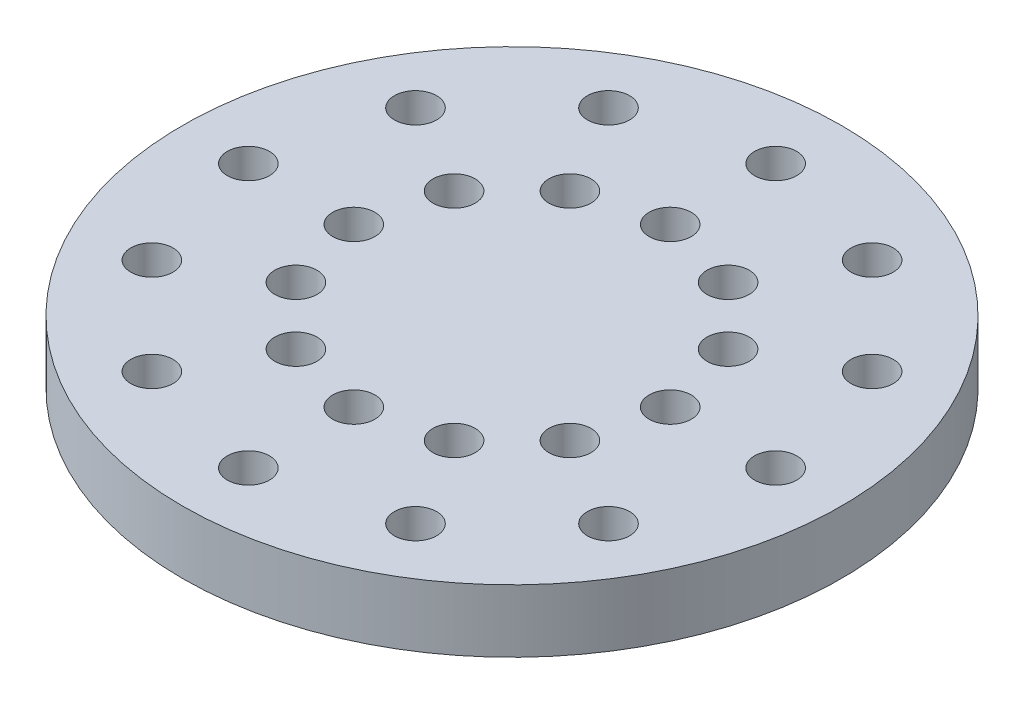
ISO-10303-21;
HEADER;
FILE_DESCRIPTION(('STEP AP214'),'2;1');
FILE_NAME('part.step','',(''),(''),'','','');
FILE_SCHEMA(('AUTOMOTIVE_DESIGN { 1 0 10303 214 1 1 1 1 }'));
ENDSEC;
DATA;
#1=APPLICATION_CONTEXT('core data for automotive mechanical design processes');
#2=APPLICATION_PROTOCOL_DEFINITION('international standard','automotive_design',2000,#1);
#3=PRODUCT_CONTEXT('',#1,'mechanical');
#4=PRODUCT('Part','Part','',(#3));
#5=PRODUCT_RELATED_PRODUCT_CATEGORY('part','',(#4));
#6=PRODUCT_DEFINITION_FORMATION('','',#4);
#7=PRODUCT_DEFINITION_CONTEXT('part definition',#1,'design');
#8=PRODUCT_DEFINITION('design','',#6,#7);
#9=PRODUCT_DEFINITION_SHAPE('','',#8);
#10=(LENGTH_UNIT() NAMED_UNIT(*) SI_UNIT(.MILLI.,.METRE.));
#11=(NAMED_UNIT(*) PLANE_ANGLE_UNIT() SI_UNIT($,.RADIAN.));
#12=(NAMED_UNIT(*) SI_UNIT($,.STERADIAN.) SOLID_ANGLE_UNIT());
#13=UNCERTAINTY_MEASURE_WITH_UNIT(LENGTH_MEASURE(1.E-05),#10,'distance_accuracy_value','');
#14=(GEOMETRIC_REPRESENTATION_CONTEXT(3) GLOBAL_UNCERTAINTY_ASSIGNED_CONTEXT((#13)) GLOBAL_UNIT_ASSIGNED_CONTEXT((#10,
#11,#12)) REPRESENTATION_CONTEXT('',''));
#15=CARTESIAN_POINT('',(0.,0.,0.));
#16=DIRECTION('',(0.,0.,1.));
#17=DIRECTION('',(1.,0.,0.));
#18=AXIS2_PLACEMENT_3D('',#15,#16,#17);
#19=CARTESIAN_POINT('',(0.,4.7625,0.));
#20=DIRECTION('',(0.,1.,0.));
#21=DIRECTION('',(0.,0.,1.));
#22=AXIS2_PLACEMENT_3D('',#19,#20,#21);
#23=PLANE('',#22);
#24=CARTESIAN_POINT('',(17.3205080756889,4.7625,-9.99999999999978));
#25=DIRECTION('',(0.,1.,0.));
#26=DIRECTION('',(0.,0.,1.));
#27=AXIS2_PLACEMENT_3D('',#24,#25,#26);
#28=CIRCLE('',#27,1.6);
#29=CARTESIAN_POINT('',(17.3205080756889,4.7625,-8.39999999999978));
#30=VERTEX_POINT('',#29);
#31=EDGE_CURVE('E172',#30,#30,#28,.T.);
#32=ORIENTED_EDGE('',*,*,#31,.F.);
#33=EDGE_LOOP('',(#32));
#34=FACE_BOUND('',#33,.T.);
#35=CARTESIAN_POINT('',(10.0000000000002,4.7625,-17.3205080756887));
#36=DIRECTION('',(0.,1.,0.));
#37=DIRECTION('',(0.,0.,1.));
#38=AXIS2_PLACEMENT_3D('',#35,#36,#37);
#39=CIRCLE('',#38,1.6);
#40=CARTESIAN_POINT('',(10.0000000000002,4.7625,-15.7205080756887));
#41=VERTEX_POINT('',#40);
#42=EDGE_CURVE('E160',#41,#41,#39,.T.);
#43=ORIENTED_EDGE('',*,*,#42,.F.);
#44=EDGE_LOOP('',(#43));
#45=FACE_BOUND('',#44,.T.);
#46=CARTESIAN_POINT('',(2.09488880330588E-13,4.7625,-20.));
#47=DIRECTION('',(0.,1.,0.));
#48=DIRECTION('',(0.,0.,1.));
#49=AXIS2_PLACEMENT_3D('',#46,#47,#48);
#50=CIRCLE('',#49,1.6);
#51=CARTESIAN_POINT('',(2.09488880330588E-13,4.7625,-18.4));
#52=VERTEX_POINT('',#51);
#53=EDGE_CURVE('E148',#52,#52,#50,.T.);
#54=ORIENTED_EDGE('',*,*,#53,.F.);
#55=EDGE_LOOP('',(#54));
#56=FACE_BOUND('',#55,.T.);
#57=CARTESIAN_POINT('',(-9.99999999999984,4.7625,-17.3205080756889));
#58=DIRECTION('',(0.,1.,0.));
#59=DIRECTION('',(0.,0.,1.));
#60=AXIS2_PLACEMENT_3D('',#57,#58,#59);
#61=CIRCLE('',#60,1.6);
#62=CARTESIAN_POINT('',(-9.99999999999984,4.7625,-15.7205080756889));
#63=VERTEX_POINT('',#62);
#64=EDGE_CURVE('E136',#63,#63,#61,.T.);
#65=ORIENTED_EDGE('',*,*,#64,.F.);
#66=EDGE_LOOP('',(#65));
#67=FACE_BOUND('',#66,.T.);
#68=CARTESIAN_POINT('',(-17.3205080756887,4.7625,-10.0000000000001));
#69=DIRECTION('',(0.,1.,0.));
#70=DIRECTION('',(0.,0.,1.));
#71=AXIS2_PLACEMENT_3D('',#68,#69,#70);
#72=CIRCLE('',#71,1.6);
#73=CARTESIAN_POINT('',(-17.3205080756887,4.7625,-8.40000000000015));
#74=VERTEX_POINT('',#73);
#75=EDGE_CURVE('E124',#74,#74,#72,.T.);
#76=ORIENTED_EDGE('',*,*,#75,.F.);
#77=EDGE_LOOP('',(#76));
#78=FACE_BOUND('',#77,.T.);
#79=CARTESIAN_POINT('',(-20.,4.7625,-1.39659253553725E-13));
#80=DIRECTION('',(0.,1.,0.));
#81=DIRECTION('',(0.,0.,1.));
#82=AXIS2_PLACEMENT_3D('',#79,#80,#81);
#83=CIRCLE('',#82,1.6);
#84=CARTESIAN_POINT('',(-20.,4.7625,1.59999999999986));
#85=VERTEX_POINT('',#84);
#86=EDGE_CURVE('E112',#85,#85,#83,.T.);
#87=ORIENTED_EDGE('',*,*,#86,.F.);
#88=EDGE_LOOP('',(#87));
#89=FACE_BOUND('',#88,.T.);
#90=CARTESIAN_POINT('',(-17.3205080756888,4.7625,9.9999999999999));
#91=DIRECTION('',(0.,1.,0.));
#92=DIRECTION('',(0.,0.,1.));
#93=AXIS2_PLACEMENT_3D('',#90,#91,#92);
#94=CIRCLE('',#93,1.6);
#95=CARTESIAN_POINT('',(-17.3205080756888,4.7625,11.5999999999999));
#96=VERTEX_POINT('',#95);
#97=EDGE_CURVE('E100',#96,#96,#94,.T.);
#98=ORIENTED_EDGE('',*,*,#97,.F.);
#99=EDGE_LOOP('',(#98));
#100=FACE_BOUND('',#99,.T.);
#101=CARTESIAN_POINT('',(-10.0000000000001,4.7625,17.3205080756887));
#102=DIRECTION('',(0.,1.,0.));
#103=DIRECTION('',(0.,0.,1.));
#104=AXIS2_PLACEMENT_3D('',#101,#102,#103);
#105=CIRCLE('',#104,1.6);
#106=CARTESIAN_POINT('',(-10.0000000000001,4.7625,18.9205080756887));
#107=VERTEX_POINT('',#106);
#108=EDGE_CURVE('E88',#107,#107,#105,.T.);
#109=ORIENTED_EDGE('',*,*,#108,.F.);
#110=EDGE_LOOP('',(#109));
#111=FACE_BOUND('',#110,.T.);
#112=CARTESIAN_POINT('',(0.,4.7625,20.));
#113=DIRECTION('',(0.,1.,0.));
#114=DIRECTION('',(0.,0.,1.));
#115=AXIS2_PLACEMENT_3D('',#112,#113,#114);
#116=CIRCLE('',#115,1.6);
#117=CARTESIAN_POINT('',(0.,4.7625,21.6));
#118=VERTEX_POINT('',#117);
#119=EDGE_CURVE('E76',#118,#118,#116,.T.);
#120=ORIENTED_EDGE('',*,*,#119,.F.);
#121=EDGE_LOOP('',(#120));
#122=FACE_BOUND('',#121,.T.);
#123=CARTESIAN_POINT('',(9.99999999999996,4.7625,17.3205080756888));
#124=DIRECTION('',(0.,1.,0.));
#125=DIRECTION('',(0.,0.,1.));
#126=AXIS2_PLACEMENT_3D('',#123,#124,#125);
#127=CIRCLE('',#126,1.6);
#128=CARTESIAN_POINT('',(9.99999999999996,4.7625,18.9205080756888));
#129=VERTEX_POINT('',#128);
#130=EDGE_CURVE('E64',#129,#129,#127,.T.);
#131=ORIENTED_EDGE('',*,*,#130,.F.);
#132=EDGE_LOOP('',(#131));
#133=FACE_BOUND('',#132,.T.);
#134=CARTESIAN_POINT('',(17.3205080756888,4.7625,10.));
#135=DIRECTION('',(0.,1.,0.));
#136=DIRECTION('',(0.,0.,1.));
#137=AXIS2_PLACEMENT_3D('',#134,#135,#136);
#138=CIRCLE('',#137,1.6);
#139=CARTESIAN_POINT('',(17.3205080756888,4.7625,11.6));
#140=VERTEX_POINT('',#139);
#141=EDGE_CURVE('E52',#140,#140,#138,.T.);
#142=ORIENTED_EDGE('',*,*,#141,.F.);
#143=EDGE_LOOP('',(#142));
#144=FACE_BOUND('',#143,.T.);
#145=CARTESIAN_POINT('',(20.,4.7625,0.));
#146=DIRECTION('',(0.,1.,0.));
#147=DIRECTION('',(0.,0.,1.));
#148=AXIS2_PLACEMENT_3D('',#145,#146,#147);
#149=CIRCLE('',#148,1.6);
#150=CARTESIAN_POINT('',(20.,4.7625,1.6));
#151=VERTEX_POINT('',#150);
#152=EDGE_CURVE('E41',#151,#151,#149,.T.);
#153=ORIENTED_EDGE('',*,*,#152,.F.);
#154=EDGE_LOOP('',(#153));
#155=FACE_BOUND('',#154,.T.);
#156=CARTESIAN_POINT('',(0.,4.7625,0.));
#157=DIRECTION('',(0.,1.,0.));
#158=DIRECTION('',(0.,0.,1.));
#159=AXIS2_PLACEMENT_3D('',#156,#157,#158);
#160=CIRCLE('',#159,25.);
#161=CARTESIAN_POINT('',(0.,4.7625,25.));
#162=VERTEX_POINT('',#161);
#163=EDGE_CURVE('E10',#162,#162,#160,.T.);
#164=ORIENTED_EDGE('',*,*,#163,.T.);
#165=EDGE_LOOP('',(#164));
#166=FACE_BOUND('',#165,.T.);
#167=CARTESIAN_POINT('',(12.,4.7625,0.));
#168=DIRECTION('',(0.,1.,0.));
#169=DIRECTION('',(0.,0.,1.));
#170=AXIS2_PLACEMENT_3D('',#167,#168,#169);
#171=CIRCLE('',#170,1.6);
#172=CARTESIAN_POINT('',(12.,4.7625,1.6));
#173=VERTEX_POINT('',#172);
#174=EDGE_CURVE('E46',#173,#173,#171,.T.);
#175=ORIENTED_EDGE('',*,*,#174,.F.);
#176=EDGE_LOOP('',(#175));
#177=FACE_BOUND('',#176,.T.);
#178=CARTESIAN_POINT('',(10.3923048454133,4.7625,6.));
#179=DIRECTION('',(0.,1.,0.));
#180=DIRECTION('',(0.,0.,1.));
#181=AXIS2_PLACEMENT_3D('',#178,#179,#180);
#182=CIRCLE('',#181,1.6);
#183=CARTESIAN_POINT('',(10.3923048454133,4.7625,7.6));
#184=VERTEX_POINT('',#183);
#185=EDGE_CURVE('E58',#184,#184,#182,.T.);
#186=ORIENTED_EDGE('',*,*,#185,.F.);
#187=EDGE_LOOP('',(#186));
#188=FACE_BOUND('',#187,.T.);
#189=CARTESIAN_POINT('',(6.,4.7625,10.3923048454133));
#190=DIRECTION('',(0.,1.,0.));
#191=DIRECTION('',(0.,0.,1.));
#192=AXIS2_PLACEMENT_3D('',#189,#190,#191);
#193=CIRCLE('',#192,1.6);
#194=CARTESIAN_POINT('',(6.,4.7625,11.9923048454133));
#195=VERTEX_POINT('',#194);
#196=EDGE_CURVE('E70',#195,#195,#193,.T.);
#197=ORIENTED_EDGE('',*,*,#196,.F.);
#198=EDGE_LOOP('',(#197));
#199=FACE_BOUND('',#198,.T.);
#200=CARTESIAN_POINT('',(0.,4.7625,12.));
#201=DIRECTION('',(0.,1.,0.));
#202=DIRECTION('',(0.,0.,1.));
#203=AXIS2_PLACEMENT_3D('',#200,#201,#202);
#204=CIRCLE('',#203,1.6);
#205=CARTESIAN_POINT('',(0.,4.7625,13.6));
#206=VERTEX_POINT('',#205);
#207=EDGE_CURVE('E82',#206,#206,#204,.T.);
#208=ORIENTED_EDGE('',*,*,#207,.F.);
#209=EDGE_LOOP('',(#208));
#210=FACE_BOUND('',#209,.T.);
#211=CARTESIAN_POINT('',(-6.,4.7625,10.3923048454133));
#212=DIRECTION('',(0.,1.,0.));
#213=DIRECTION('',(0.,0.,1.));
#214=AXIS2_PLACEMENT_3D('',#211,#212,#213);
#215=CIRCLE('',#214,1.6);
#216=CARTESIAN_POINT('',(-6.,4.7625,11.9923048454133));
#217=VERTEX_POINT('',#216);
#218=EDGE_CURVE('E94',#217,#217,#215,.T.);
#219=ORIENTED_EDGE('',*,*,#218,.F.);
#220=EDGE_LOOP('',(#219));
#221=FACE_BOUND('',#220,.T.);
#222=CARTESIAN_POINT('',(-10.3923048454133,4.7625,6.));
#223=DIRECTION('',(0.,1.,0.));
#224=DIRECTION('',(0.,0.,1.));
#225=AXIS2_PLACEMENT_3D('',#222,#223,#224);
#226=CIRCLE('',#225,1.6);
#227=CARTESIAN_POINT('',(-10.3923048454133,4.7625,7.6));
#228=VERTEX_POINT('',#227);
#229=EDGE_CURVE('E106',#228,#228,#226,.T.);
#230=ORIENTED_EDGE('',*,*,#229,.F.);
#231=EDGE_LOOP('',(#230));
#232=FACE_BOUND('',#231,.T.);
#233=CARTESIAN_POINT('',(-12.,4.7625,0.));
#234=DIRECTION('',(0.,1.,0.));
#235=DIRECTION('',(0.,0.,1.));
#236=AXIS2_PLACEMENT_3D('',#233,#234,#235);
#237=CIRCLE('',#236,1.6);
#238=CARTESIAN_POINT('',(-12.,4.7625,1.6));
#239=VERTEX_POINT('',#238);
#240=EDGE_CURVE('E118',#239,#239,#237,.T.);
#241=ORIENTED_EDGE('',*,*,#240,.F.);
#242=EDGE_LOOP('',(#241));
#243=FACE_BOUND('',#242,.T.);
#244=CARTESIAN_POINT('',(-10.3923048454133,4.7625,-6.));
#245=DIRECTION('',(0.,1.,0.));
#246=DIRECTION('',(0.,0.,1.));
#247=AXIS2_PLACEMENT_3D('',#244,#245,#246);
#248=CIRCLE('',#247,1.6);
#249=CARTESIAN_POINT('',(-10.3923048454133,4.7625,-4.4));
#250=VERTEX_POINT('',#249);
#251=EDGE_CURVE('E130',#250,#250,#248,.T.);
#252=ORIENTED_EDGE('',*,*,#251,.F.);
#253=EDGE_LOOP('',(#252));
#254=FACE_BOUND('',#253,.T.);
#255=CARTESIAN_POINT('',(-6.,4.7625,-10.3923048454133));
#256=DIRECTION('',(0.,1.,0.));
#257=DIRECTION('',(0.,0.,1.));
#258=AXIS2_PLACEMENT_3D('',#255,#256,#257);
#259=CIRCLE('',#258,1.6);
#260=CARTESIAN_POINT('',(-6.,4.7625,-8.79230484541326));
#261=VERTEX_POINT('',#260);
#262=EDGE_CURVE('E142',#261,#261,#259,.T.);
#263=ORIENTED_EDGE('',*,*,#262,.F.);
#264=EDGE_LOOP('',(#263));
#265=FACE_BOUND('',#264,.T.);
#266=CARTESIAN_POINT('',(0.,4.7625,-12.));
#267=DIRECTION('',(0.,1.,0.));
#268=DIRECTION('',(0.,0.,1.));
#269=AXIS2_PLACEMENT_3D('',#266,#267,#268);
#270=CIRCLE('',#269,1.6);
#271=CARTESIAN_POINT('',(0.,4.7625,-10.4));
#272=VERTEX_POINT('',#271);
#273=EDGE_CURVE('E154',#272,#272,#270,.T.);
#274=ORIENTED_EDGE('',*,*,#273,.F.);
#275=EDGE_LOOP('',(#274));
#276=FACE_BOUND('',#275,.T.);
#277=CARTESIAN_POINT('',(5.99999999999999,4.7625,-10.3923048454133));
#278=DIRECTION('',(0.,1.,0.));
#279=DIRECTION('',(0.,0.,1.));
#280=AXIS2_PLACEMENT_3D('',#277,#278,#279);
#281=CIRCLE('',#280,1.6);
#282=CARTESIAN_POINT('',(5.99999999999999,4.7625,-8.79230484541327));
#283=VERTEX_POINT('',#282);
#284=EDGE_CURVE('E166',#283,#283,#281,.T.);
#285=ORIENTED_EDGE('',*,*,#284,.F.);
#286=EDGE_LOOP('',(#285));
#287=FACE_BOUND('',#286,.T.);
#288=CARTESIAN_POINT('',(10.3923048454133,4.7625,-6.00000000000001));
#289=DIRECTION('',(0.,1.,0.));
#290=DIRECTION('',(0.,0.,1.));
#291=AXIS2_PLACEMENT_3D('',#288,#289,#290);
#292=CIRCLE('',#291,1.6);
#293=CARTESIAN_POINT('',(10.3923048454133,4.7625,-4.40000000000001));
#294=VERTEX_POINT('',#293);
#295=EDGE_CURVE('E178',#294,#294,#292,.T.);
#296=ORIENTED_EDGE('',*,*,#295,.F.);
#297=EDGE_LOOP('',(#296));
#298=FACE_BOUND('',#297,.T.);
#299=ADVANCED_FACE('F30',(#34,#45,#56,#67,#78,#89,#100,#111,#122,#133,#144,#155,#166,#177,#188,
#199,#210,#221,#232,#243,#254,#265,#276,#287,#298),#23,.T.);
#300=CARTESIAN_POINT('',(0.,0.,0.));
#301=DIRECTION('',(0.,1.,0.));
#302=DIRECTION('',(0.,0.,1.));
#303=AXIS2_PLACEMENT_3D('',#300,#301,#302);
#304=PLANE('',#303);
#305=CARTESIAN_POINT('',(17.3205080756889,0.,-9.99999999999978));
#306=DIRECTION('',(0.,1.,0.));
#307=DIRECTION('',(0.,0.,1.));
#308=AXIS2_PLACEMENT_3D('',#305,#306,#307);
#309=CIRCLE('',#308,1.6);
#310=CARTESIAN_POINT('',(17.3205080756889,0.,-8.39999999999978));
#311=VERTEX_POINT('',#310);
#312=EDGE_CURVE('E175',#311,#311,#309,.T.);
#313=ORIENTED_EDGE('',*,*,#312,.T.);
#314=EDGE_LOOP('',(#313));
#315=FACE_BOUND('',#314,.T.);
#316=CARTESIAN_POINT('',(10.0000000000002,0.,-17.3205080756887));
#317=DIRECTION('',(0.,1.,0.));
#318=DIRECTION('',(0.,0.,1.));
#319=AXIS2_PLACEMENT_3D('',#316,#317,#318);
#320=CIRCLE('',#319,1.6);
#321=CARTESIAN_POINT('',(10.0000000000002,0.,-15.7205080756887));
#322=VERTEX_POINT('',#321);
#323=EDGE_CURVE('E163',#322,#322,#320,.T.);
#324=ORIENTED_EDGE('',*,*,#323,.T.);
#325=EDGE_LOOP('',(#324));
#326=FACE_BOUND('',#325,.T.);
#327=CARTESIAN_POINT('',(2.09488880330588E-13,0.,-20.));
#328=DIRECTION('',(0.,1.,0.));
#329=DIRECTION('',(0.,0.,1.));
#330=AXIS2_PLACEMENT_3D('',#327,#328,#329);
#331=CIRCLE('',#330,1.6);
#332=CARTESIAN_POINT('',(2.09488880330588E-13,0.,-18.4));
#333=VERTEX_POINT('',#332);
#334=EDGE_CURVE('E151',#333,#333,#331,.T.);
#335=ORIENTED_EDGE('',*,*,#334,.T.);
#336=EDGE_LOOP('',(#335));
#337=FACE_BOUND('',#336,.T.);
#338=CARTESIAN_POINT('',(-9.99999999999984,0.,-17.3205080756889));
#339=DIRECTION('',(0.,1.,0.));
#340=DIRECTION('',(0.,0.,1.));
#341=AXIS2_PLACEMENT_3D('',#338,#339,#340);
#342=CIRCLE('',#341,1.6);
#343=CARTESIAN_POINT('',(-9.99999999999984,0.,-15.7205080756889));
#344=VERTEX_POINT('',#343);
#345=EDGE_CURVE('E139',#344,#344,#342,.T.);
#346=ORIENTED_EDGE('',*,*,#345,.T.);
#347=EDGE_LOOP('',(#346));
#348=FACE_BOUND('',#347,.T.);
#349=CARTESIAN_POINT('',(-17.3205080756887,0.,-10.0000000000001));
#350=DIRECTION('',(0.,1.,0.));
#351=DIRECTION('',(0.,0.,1.));
#352=AXIS2_PLACEMENT_3D('',#349,#350,#351);
#353=CIRCLE('',#352,1.6);
#354=CARTESIAN_POINT('',(-17.3205080756887,0.,-8.40000000000015));
#355=VERTEX_POINT('',#354);
#356=EDGE_CURVE('E127',#355,#355,#353,.T.);
#357=ORIENTED_EDGE('',*,*,#356,.T.);
#358=EDGE_LOOP('',(#357));
#359=FACE_BOUND('',#358,.T.);
#360=CARTESIAN_POINT('',(-20.,0.,-1.39659253553725E-13));
#361=DIRECTION('',(0.,1.,0.));
#362=DIRECTION('',(0.,0.,1.));
#363=AXIS2_PLACEMENT_3D('',#360,#361,#362);
#364=CIRCLE('',#363,1.6);
#365=CARTESIAN_POINT('',(-20.,0.,1.59999999999986));
#366=VERTEX_POINT('',#365);
#367=EDGE_CURVE('E115',#366,#366,#364,.T.);
#368=ORIENTED_EDGE('',*,*,#367,.T.);
#369=EDGE_LOOP('',(#368));
#370=FACE_BOUND('',#369,.T.);
#371=CARTESIAN_POINT('',(-17.3205080756888,0.,9.9999999999999));
#372=DIRECTION('',(0.,1.,0.));
#373=DIRECTION('',(0.,0.,1.));
#374=AXIS2_PLACEMENT_3D('',#371,#372,#373);
#375=CIRCLE('',#374,1.6);
#376=CARTESIAN_POINT('',(-17.3205080756888,0.,11.5999999999999));
#377=VERTEX_POINT('',#376);
#378=EDGE_CURVE('E103',#377,#377,#375,.T.);
#379=ORIENTED_EDGE('',*,*,#378,.T.);
#380=EDGE_LOOP('',(#379));
#381=FACE_BOUND('',#380,.T.);
#382=CARTESIAN_POINT('',(-10.0000000000001,0.,17.3205080756887));
#383=DIRECTION('',(0.,1.,0.));
#384=DIRECTION('',(0.,0.,1.));
#385=AXIS2_PLACEMENT_3D('',#382,#383,#384);
#386=CIRCLE('',#385,1.6);
#387=CARTESIAN_POINT('',(-10.0000000000001,0.,18.9205080756887));
#388=VERTEX_POINT('',#387);
#389=EDGE_CURVE('E91',#388,#388,#386,.T.);
#390=ORIENTED_EDGE('',*,*,#389,.T.);
#391=EDGE_LOOP('',(#390));
#392=FACE_BOUND('',#391,.T.);
#393=CARTESIAN_POINT('',(0.,0.,20.));
#394=DIRECTION('',(0.,1.,0.));
#395=DIRECTION('',(0.,0.,1.));
#396=AXIS2_PLACEMENT_3D('',#393,#394,#395);
#397=CIRCLE('',#396,1.6);
#398=CARTESIAN_POINT('',(0.,0.,21.6));
#399=VERTEX_POINT('',#398);
#400=EDGE_CURVE('E79',#399,#399,#397,.T.);
#401=ORIENTED_EDGE('',*,*,#400,.T.);
#402=EDGE_LOOP('',(#401));
#403=FACE_BOUND('',#402,.T.);
#404=CARTESIAN_POINT('',(9.99999999999996,0.,17.3205080756888));
#405=DIRECTION('',(0.,1.,0.));
#406=DIRECTION('',(0.,0.,1.));
#407=AXIS2_PLACEMENT_3D('',#404,#405,#406);
#408=CIRCLE('',#407,1.6);
#409=CARTESIAN_POINT('',(9.99999999999996,0.,18.9205080756888));
#410=VERTEX_POINT('',#409);
#411=EDGE_CURVE('E67',#410,#410,#408,.T.);
#412=ORIENTED_EDGE('',*,*,#411,.T.);
#413=EDGE_LOOP('',(#412));
#414=FACE_BOUND('',#413,.T.);
#415=CARTESIAN_POINT('',(17.3205080756888,0.,10.));
#416=DIRECTION('',(0.,1.,0.));
#417=DIRECTION('',(0.,0.,1.));
#418=AXIS2_PLACEMENT_3D('',#415,#416,#417);
#419=CIRCLE('',#418,1.6);
#420=CARTESIAN_POINT('',(17.3205080756888,0.,11.6));
#421=VERTEX_POINT('',#420);
#422=EDGE_CURVE('E55',#421,#421,#419,.T.);
#423=ORIENTED_EDGE('',*,*,#422,.T.);
#424=EDGE_LOOP('',(#423));
#425=FACE_BOUND('',#424,.T.);
#426=CARTESIAN_POINT('',(20.,0.,0.));
#427=DIRECTION('',(0.,1.,0.));
#428=DIRECTION('',(0.,0.,1.));
#429=AXIS2_PLACEMENT_3D('',#426,#427,#428);
#430=CIRCLE('',#429,1.6);
#431=CARTESIAN_POINT('',(20.,0.,1.6));
#432=VERTEX_POINT('',#431);
#433=EDGE_CURVE('E43',#432,#432,#430,.T.);
#434=ORIENTED_EDGE('',*,*,#433,.T.);
#435=EDGE_LOOP('',(#434));
#436=FACE_BOUND('',#435,.T.);
#437=CARTESIAN_POINT('',(0.,0.,0.));
#438=DIRECTION('',(0.,1.,0.));
#439=DIRECTION('',(0.,0.,1.));
#440=AXIS2_PLACEMENT_3D('',#437,#438,#439);
#441=CIRCLE('',#440,25.);
#442=CARTESIAN_POINT('',(0.,0.,25.));
#443=VERTEX_POINT('',#442);
#444=EDGE_CURVE('E34',#443,#443,#441,.T.);
#445=ORIENTED_EDGE('',*,*,#444,.F.);
#446=EDGE_LOOP('',(#445));
#447=FACE_BOUND('',#446,.T.);
#448=CARTESIAN_POINT('',(12.,0.,0.));
#449=DIRECTION('',(0.,1.,0.));
#450=DIRECTION('',(0.,0.,1.));
#451=AXIS2_PLACEMENT_3D('',#448,#449,#450);
#452=CIRCLE('',#451,1.6);
#453=CARTESIAN_POINT('',(12.,0.,1.6));
#454=VERTEX_POINT('',#453);
#455=EDGE_CURVE('E49',#454,#454,#452,.T.);
#456=ORIENTED_EDGE('',*,*,#455,.T.);
#457=EDGE_LOOP('',(#456));
#458=FACE_BOUND('',#457,.T.);
#459=CARTESIAN_POINT('',(10.3923048454133,0.,6.));
#460=DIRECTION('',(0.,1.,0.));
#461=DIRECTION('',(0.,0.,1.));
#462=AXIS2_PLACEMENT_3D('',#459,#460,#461);
#463=CIRCLE('',#462,1.6);
#464=CARTESIAN_POINT('',(10.3923048454133,0.,7.6));
#465=VERTEX_POINT('',#464);
#466=EDGE_CURVE('E61',#465,#465,#463,.T.);
#467=ORIENTED_EDGE('',*,*,#466,.T.);
#468=EDGE_LOOP('',(#467));
#469=FACE_BOUND('',#468,.T.);
#470=CARTESIAN_POINT('',(6.,0.,10.3923048454133));
#471=DIRECTION('',(0.,1.,0.));
#472=DIRECTION('',(0.,0.,1.));
#473=AXIS2_PLACEMENT_3D('',#470,#471,#472);
#474=CIRCLE('',#473,1.6);
#475=CARTESIAN_POINT('',(6.,0.,11.9923048454133));
#476=VERTEX_POINT('',#475);
#477=EDGE_CURVE('E73',#476,#476,#474,.T.);
#478=ORIENTED_EDGE('',*,*,#477,.T.);
#479=EDGE_LOOP('',(#478));
#480=FACE_BOUND('',#479,.T.);
#481=CARTESIAN_POINT('',(0.,0.,12.));
#482=DIRECTION('',(0.,1.,0.));
#483=DIRECTION('',(0.,0.,1.));
#484=AXIS2_PLACEMENT_3D('',#481,#482,#483);
#485=CIRCLE('',#484,1.6);
#486=CARTESIAN_POINT('',(0.,0.,13.6));
#487=VERTEX_POINT('',#486);
#488=EDGE_CURVE('E85',#487,#487,#485,.T.);
#489=ORIENTED_EDGE('',*,*,#488,.T.);
#490=EDGE_LOOP('',(#489));
#491=FACE_BOUND('',#490,.T.);
#492=CARTESIAN_POINT('',(-6.,0.,10.3923048454133));
#493=DIRECTION('',(0.,1.,0.));
#494=DIRECTION('',(0.,0.,1.));
#495=AXIS2_PLACEMENT_3D('',#492,#493,#494);
#496=CIRCLE('',#495,1.6);
#497=CARTESIAN_POINT('',(-6.,0.,11.9923048454133));
#498=VERTEX_POINT('',#497);
#499=EDGE_CURVE('E97',#498,#498,#496,.T.);
#500=ORIENTED_EDGE('',*,*,#499,.T.);
#501=EDGE_LOOP('',(#500));
#502=FACE_BOUND('',#501,.T.);
#503=CARTESIAN_POINT('',(-10.3923048454133,0.,6.));
#504=DIRECTION('',(0.,1.,0.));
#505=DIRECTION('',(0.,0.,1.));
#506=AXIS2_PLACEMENT_3D('',#503,#504,#505);
#507=CIRCLE('',#506,1.6);
#508=CARTESIAN_POINT('',(-10.3923048454133,0.,7.6));
#509=VERTEX_POINT('',#508);
#510=EDGE_CURVE('E109',#509,#509,#507,.T.);
#511=ORIENTED_EDGE('',*,*,#510,.T.);
#512=EDGE_LOOP('',(#511));
#513=FACE_BOUND('',#512,.T.);
#514=CARTESIAN_POINT('',(-12.,0.,0.));
#515=DIRECTION('',(0.,1.,0.));
#516=DIRECTION('',(0.,0.,1.));
#517=AXIS2_PLACEMENT_3D('',#514,#515,#516);
#518=CIRCLE('',#517,1.6);
#519=CARTESIAN_POINT('',(-12.,0.,1.6));
#520=VERTEX_POINT('',#519);
#521=EDGE_CURVE('E121',#520,#520,#518,.T.);
#522=ORIENTED_EDGE('',*,*,#521,.T.);
#523=EDGE_LOOP('',(#522));
#524=FACE_BOUND('',#523,.T.);
#525=CARTESIAN_POINT('',(-10.3923048454133,0.,-6.));
#526=DIRECTION('',(0.,1.,0.));
#527=DIRECTION('',(0.,0.,1.));
#528=AXIS2_PLACEMENT_3D('',#525,#526,#527);
#529=CIRCLE('',#528,1.6);
#530=CARTESIAN_POINT('',(-10.3923048454133,0.,-4.4));
#531=VERTEX_POINT('',#530);
#532=EDGE_CURVE('E133',#531,#531,#529,.T.);
#533=ORIENTED_EDGE('',*,*,#532,.T.);
#534=EDGE_LOOP('',(#533));
#535=FACE_BOUND('',#534,.T.);
#536=CARTESIAN_POINT('',(-6.,0.,-10.3923048454133));
#537=DIRECTION('',(0.,1.,0.));
#538=DIRECTION('',(0.,0.,1.));
#539=AXIS2_PLACEMENT_3D('',#536,#537,#538);
#540=CIRCLE('',#539,1.6);
#541=CARTESIAN_POINT('',(-6.,0.,-8.79230484541326));
#542=VERTEX_POINT('',#541);
#543=EDGE_CURVE('E145',#542,#542,#540,.T.);
#544=ORIENTED_EDGE('',*,*,#543,.T.);
#545=EDGE_LOOP('',(#544));
#546=FACE_BOUND('',#545,.T.);
#547=CARTESIAN_POINT('',(0.,0.,-12.));
#548=DIRECTION('',(0.,1.,0.));
#549=DIRECTION('',(0.,0.,1.));
#550=AXIS2_PLACEMENT_3D('',#547,#548,#549);
#551=CIRCLE('',#550,1.6);
#552=CARTESIAN_POINT('',(0.,0.,-10.4));
#553=VERTEX_POINT('',#552);
#554=EDGE_CURVE('E157',#553,#553,#551,.T.);
#555=ORIENTED_EDGE('',*,*,#554,.T.);
#556=EDGE_LOOP('',(#555));
#557=FACE_BOUND('',#556,.T.);
#558=CARTESIAN_POINT('',(5.99999999999999,0.,-10.3923048454133));
#559=DIRECTION('',(0.,1.,0.));
#560=DIRECTION('',(0.,0.,1.));
#561=AXIS2_PLACEMENT_3D('',#558,#559,#560);
#562=CIRCLE('',#561,1.6);
#563=CARTESIAN_POINT('',(5.99999999999999,0.,-8.79230484541327));
#564=VERTEX_POINT('',#563);
#565=EDGE_CURVE('E169',#564,#564,#562,.T.);
#566=ORIENTED_EDGE('',*,*,#565,.T.);
#567=EDGE_LOOP('',(#566));
#568=FACE_BOUND('',#567,.T.);
#569=CARTESIAN_POINT('',(10.3923048454133,0.,-6.00000000000001));
#570=DIRECTION('',(0.,1.,0.));
#571=DIRECTION('',(0.,0.,1.));
#572=AXIS2_PLACEMENT_3D('',#569,#570,#571);
#573=CIRCLE('',#572,1.6);
#574=CARTESIAN_POINT('',(10.3923048454133,0.,-4.40000000000001));
#575=VERTEX_POINT('',#574);
#576=EDGE_CURVE('E181',#575,#575,#573,.T.);
#577=ORIENTED_EDGE('',*,*,#576,.T.);
#578=EDGE_LOOP('',(#577));
#579=FACE_BOUND('',#578,.T.);
#580=ADVANCED_FACE('F191',(#315,#326,#337,#348,#359,#370,#381,#392,#403,#414,#425,#436,#447,
#458,#469,#480,#491,#502,#513,#524,#535,#546,#557,#568,#579),#304,.F.);
#581=CARTESIAN_POINT('',(0.,4.7625,0.));
#582=DIRECTION('',(0.,-1.,0.));
#583=DIRECTION('',(0.,0.,-1.));
#584=AXIS2_PLACEMENT_3D('',#581,#582,#583);
#585=CYLINDRICAL_SURFACE('',#584,25.);
#586=ORIENTED_EDGE('',*,*,#163,.F.);
#587=EDGE_LOOP('',(#586));
#588=FACE_BOUND('',#587,.T.);
#589=ORIENTED_EDGE('',*,*,#444,.T.);
#590=EDGE_LOOP('',(#589));
#591=FACE_BOUND('',#590,.T.);
#592=ADVANCED_FACE('F32',(#588,#591),#585,.T.);
#593=CARTESIAN_POINT('',(20.,4.7625,0.));
#594=DIRECTION('',(0.,-1.,0.));
#595=DIRECTION('',(0.,0.,-1.));
#596=AXIS2_PLACEMENT_3D('',#593,#594,#595);
#597=CYLINDRICAL_SURFACE('',#596,1.6);
#598=ORIENTED_EDGE('',*,*,#152,.T.);
#599=EDGE_LOOP('',(#598));
#600=FACE_BOUND('',#599,.T.);
#601=ORIENTED_EDGE('',*,*,#433,.F.);
#602=EDGE_LOOP('',(#601));
#603=FACE_BOUND('',#602,.T.);
#604=ADVANCED_FACE('F201',(#600,#603),#597,.F.);
#605=CARTESIAN_POINT('',(12.,4.7625,0.));
#606=DIRECTION('',(0.,-1.,0.));
#607=DIRECTION('',(0.,0.,-1.));
#608=AXIS2_PLACEMENT_3D('',#605,#606,#607);
#609=CYLINDRICAL_SURFACE('',#608,1.6);
#610=ORIENTED_EDGE('',*,*,#174,.T.);
#611=EDGE_LOOP('',(#610));
#612=FACE_BOUND('',#611,.T.);
#613=ORIENTED_EDGE('',*,*,#455,.F.);
#614=EDGE_LOOP('',(#613));
#615=FACE_BOUND('',#614,.T.);
#616=ADVANCED_FACE('F204',(#612,#615),#609,.F.);
#617=CARTESIAN_POINT('',(17.3205080756888,4.7625,10.));
#618=DIRECTION('',(0.,-1.,0.));
#619=DIRECTION('',(0.,0.,-1.));
#620=AXIS2_PLACEMENT_3D('',#617,#618,#619);
#621=CYLINDRICAL_SURFACE('',#620,1.6);
#622=ORIENTED_EDGE('',*,*,#141,.T.);
#623=EDGE_LOOP('',(#622));
#624=FACE_BOUND('',#623,.T.);
#625=ORIENTED_EDGE('',*,*,#422,.F.);
#626=EDGE_LOOP('',(#625));
#627=FACE_BOUND('',#626,.T.);
#628=ADVANCED_FACE('F208',(#624,#627),#621,.F.);
#629=CARTESIAN_POINT('',(10.3923048454133,4.7625,6.));
#630=DIRECTION('',(0.,-1.,0.));
#631=DIRECTION('',(0.,0.,-1.));
#632=AXIS2_PLACEMENT_3D('',#629,#630,#631);
#633=CYLINDRICAL_SURFACE('',#632,1.6);
#634=ORIENTED_EDGE('',*,*,#185,.T.);
#635=EDGE_LOOP('',(#634));
#636=FACE_BOUND('',#635,.T.);
#637=ORIENTED_EDGE('',*,*,#466,.F.);
#638=EDGE_LOOP('',(#637));
#639=FACE_BOUND('',#638,.T.);
#640=ADVANCED_FACE('F212',(#636,#639),#633,.F.);
#641=CARTESIAN_POINT('',(9.99999999999996,4.7625,17.3205080756888));
#642=DIRECTION('',(0.,-1.,0.));
#643=DIRECTION('',(0.,0.,-1.));
#644=AXIS2_PLACEMENT_3D('',#641,#642,#643);
#645=CYLINDRICAL_SURFACE('',#644,1.6);
#646=ORIENTED_EDGE('',*,*,#130,.T.);
#647=EDGE_LOOP('',(#646));
#648=FACE_BOUND('',#647,.T.);
#649=ORIENTED_EDGE('',*,*,#411,.F.);
#650=EDGE_LOOP('',(#649));
#651=FACE_BOUND('',#650,.T.);
#652=ADVANCED_FACE('F216',(#648,#651),#645,.F.);
#653=CARTESIAN_POINT('',(6.,4.7625,10.3923048454133));
#654=DIRECTION('',(0.,-1.,0.));
#655=DIRECTION('',(0.,0.,-1.));
#656=AXIS2_PLACEMENT_3D('',#653,#654,#655);
#657=CYLINDRICAL_SURFACE('',#656,1.6);
#658=ORIENTED_EDGE('',*,*,#196,.T.);
#659=EDGE_LOOP('',(#658));
#660=FACE_BOUND('',#659,.T.);
#661=ORIENTED_EDGE('',*,*,#477,.F.);
#662=EDGE_LOOP('',(#661));
#663=FACE_BOUND('',#662,.T.);
#664=ADVANCED_FACE('F220',(#660,#663),#657,.F.);
#665=CARTESIAN_POINT('',(0.,4.7625,20.));
#666=DIRECTION('',(0.,-1.,0.));
#667=DIRECTION('',(0.,0.,-1.));
#668=AXIS2_PLACEMENT_3D('',#665,#666,#667);
#669=CYLINDRICAL_SURFACE('',#668,1.6);
#670=ORIENTED_EDGE('',*,*,#119,.T.);
#671=EDGE_LOOP('',(#670));
#672=FACE_BOUND('',#671,.T.);
#673=ORIENTED_EDGE('',*,*,#400,.F.);
#674=EDGE_LOOP('',(#673));
#675=FACE_BOUND('',#674,.T.);
#676=ADVANCED_FACE('F224',(#672,#675),#669,.F.);
#677=CARTESIAN_POINT('',(0.,4.7625,12.));
#678=DIRECTION('',(0.,-1.,0.));
#679=DIRECTION('',(0.,0.,-1.));
#680=AXIS2_PLACEMENT_3D('',#677,#678,#679);
#681=CYLINDRICAL_SURFACE('',#680,1.6);
#682=ORIENTED_EDGE('',*,*,#207,.T.);
#683=EDGE_LOOP('',(#682));
#684=FACE_BOUND('',#683,.T.);
#685=ORIENTED_EDGE('',*,*,#488,.F.);
#686=EDGE_LOOP('',(#685));
#687=FACE_BOUND('',#686,.T.);
#688=ADVANCED_FACE('F228',(#684,#687),#681,.F.);
#689=CARTESIAN_POINT('',(-10.0000000000001,4.7625,17.3205080756887));
#690=DIRECTION('',(0.,-1.,0.));
#691=DIRECTION('',(0.,0.,-1.));
#692=AXIS2_PLACEMENT_3D('',#689,#690,#691);
#693=CYLINDRICAL_SURFACE('',#692,1.6);
#694=ORIENTED_EDGE('',*,*,#108,.T.);
#695=EDGE_LOOP('',(#694));
#696=FACE_BOUND('',#695,.T.);
#697=ORIENTED_EDGE('',*,*,#389,.F.);
#698=EDGE_LOOP('',(#697));
#699=FACE_BOUND('',#698,.T.);
#700=ADVANCED_FACE('F232',(#696,#699),#693,.F.);
#701=CARTESIAN_POINT('',(-6.,4.7625,10.3923048454133));
#702=DIRECTION('',(0.,-1.,0.));
#703=DIRECTION('',(0.,0.,-1.));
#704=AXIS2_PLACEMENT_3D('',#701,#702,#703);
#705=CYLINDRICAL_SURFACE('',#704,1.6);
#706=ORIENTED_EDGE('',*,*,#218,.T.);
#707=EDGE_LOOP('',(#706));
#708=FACE_BOUND('',#707,.T.);
#709=ORIENTED_EDGE('',*,*,#499,.F.);
#710=EDGE_LOOP('',(#709));
#711=FACE_BOUND('',#710,.T.);
#712=ADVANCED_FACE('F236',(#708,#711),#705,.F.);
#713=CARTESIAN_POINT('',(-17.3205080756888,4.7625,9.9999999999999));
#714=DIRECTION('',(0.,-1.,0.));
#715=DIRECTION('',(0.,0.,-1.));
#716=AXIS2_PLACEMENT_3D('',#713,#714,#715);
#717=CYLINDRICAL_SURFACE('',#716,1.6);
#718=ORIENTED_EDGE('',*,*,#97,.T.);
#719=EDGE_LOOP('',(#718));
#720=FACE_BOUND('',#719,.T.);
#721=ORIENTED_EDGE('',*,*,#378,.F.);
#722=EDGE_LOOP('',(#721));
#723=FACE_BOUND('',#722,.T.);
#724=ADVANCED_FACE('F240',(#720,#723),#717,.F.);
#725=CARTESIAN_POINT('',(-10.3923048454133,4.7625,6.));
#726=DIRECTION('',(0.,-1.,0.));
#727=DIRECTION('',(0.,0.,-1.));
#728=AXIS2_PLACEMENT_3D('',#725,#726,#727);
#729=CYLINDRICAL_SURFACE('',#728,1.6);
#730=ORIENTED_EDGE('',*,*,#229,.T.);
#731=EDGE_LOOP('',(#730));
#732=FACE_BOUND('',#731,.T.);
#733=ORIENTED_EDGE('',*,*,#510,.F.);
#734=EDGE_LOOP('',(#733));
#735=FACE_BOUND('',#734,.T.);
#736=ADVANCED_FACE('F244',(#732,#735),#729,.F.);
#737=CARTESIAN_POINT('',(-20.,4.7625,-1.39659253553725E-13));
#738=DIRECTION('',(0.,-1.,0.));
#739=DIRECTION('',(0.,0.,-1.));
#740=AXIS2_PLACEMENT_3D('',#737,#738,#739);
#741=CYLINDRICAL_SURFACE('',#740,1.6);
#742=ORIENTED_EDGE('',*,*,#86,.T.);
#743=EDGE_LOOP('',(#742));
#744=FACE_BOUND('',#743,.T.);
#745=ORIENTED_EDGE('',*,*,#367,.F.);
#746=EDGE_LOOP('',(#745));
#747=FACE_BOUND('',#746,.T.);
#748=ADVANCED_FACE('F248',(#744,#747),#741,.F.);
#749=CARTESIAN_POINT('',(-12.,4.7625,0.));
#750=DIRECTION('',(0.,-1.,0.));
#751=DIRECTION('',(0.,0.,-1.));
#752=AXIS2_PLACEMENT_3D('',#749,#750,#751);
#753=CYLINDRICAL_SURFACE('',#752,1.6);
#754=ORIENTED_EDGE('',*,*,#240,.T.);
#755=EDGE_LOOP('',(#754));
#756=FACE_BOUND('',#755,.T.);
#757=ORIENTED_EDGE('',*,*,#521,.F.);
#758=EDGE_LOOP('',(#757));
#759=FACE_BOUND('',#758,.T.);
#760=ADVANCED_FACE('F252',(#756,#759),#753,.F.);
#761=CARTESIAN_POINT('',(-17.3205080756887,4.7625,-10.0000000000001));
#762=DIRECTION('',(0.,-1.,0.));
#763=DIRECTION('',(0.,0.,-1.));
#764=AXIS2_PLACEMENT_3D('',#761,#762,#763);
#765=CYLINDRICAL_SURFACE('',#764,1.6);
#766=ORIENTED_EDGE('',*,*,#75,.T.);
#767=EDGE_LOOP('',(#766));
#768=FACE_BOUND('',#767,.T.);
#769=ORIENTED_EDGE('',*,*,#356,.F.);
#770=EDGE_LOOP('',(#769));
#771=FACE_BOUND('',#770,.T.);
#772=ADVANCED_FACE('F256',(#768,#771),#765,.F.);
#773=CARTESIAN_POINT('',(-10.3923048454133,4.7625,-6.));
#774=DIRECTION('',(0.,-1.,0.));
#775=DIRECTION('',(0.,0.,-1.));
#776=AXIS2_PLACEMENT_3D('',#773,#774,#775);
#777=CYLINDRICAL_SURFACE('',#776,1.6);
#778=ORIENTED_EDGE('',*,*,#251,.T.);
#779=EDGE_LOOP('',(#778));
#780=FACE_BOUND('',#779,.T.);
#781=ORIENTED_EDGE('',*,*,#532,.F.);
#782=EDGE_LOOP('',(#781));
#783=FACE_BOUND('',#782,.T.);
#784=ADVANCED_FACE('F260',(#780,#783),#777,.F.);
#785=CARTESIAN_POINT('',(-9.99999999999984,4.7625,-17.3205080756889));
#786=DIRECTION('',(0.,-1.,0.));
#787=DIRECTION('',(0.,0.,-1.));
#788=AXIS2_PLACEMENT_3D('',#785,#786,#787);
#789=CYLINDRICAL_SURFACE('',#788,1.6);
#790=ORIENTED_EDGE('',*,*,#64,.T.);
#791=EDGE_LOOP('',(#790));
#792=FACE_BOUND('',#791,.T.);
#793=ORIENTED_EDGE('',*,*,#345,.F.);
#794=EDGE_LOOP('',(#793));
#795=FACE_BOUND('',#794,.T.);
#796=ADVANCED_FACE('F264',(#792,#795),#789,.F.);
#797=CARTESIAN_POINT('',(-6.,4.7625,-10.3923048454133));
#798=DIRECTION('',(0.,-1.,0.));
#799=DIRECTION('',(0.,0.,-1.));
#800=AXIS2_PLACEMENT_3D('',#797,#798,#799);
#801=CYLINDRICAL_SURFACE('',#800,1.6);
#802=ORIENTED_EDGE('',*,*,#262,.T.);
#803=EDGE_LOOP('',(#802));
#804=FACE_BOUND('',#803,.T.);
#805=ORIENTED_EDGE('',*,*,#543,.F.);
#806=EDGE_LOOP('',(#805));
#807=FACE_BOUND('',#806,.T.);
#808=ADVANCED_FACE('F268',(#804,#807),#801,.F.);
#809=CARTESIAN_POINT('',(2.09488880330588E-13,4.7625,-20.));
#810=DIRECTION('',(0.,-1.,0.));
#811=DIRECTION('',(0.,0.,-1.));
#812=AXIS2_PLACEMENT_3D('',#809,#810,#811);
#813=CYLINDRICAL_SURFACE('',#812,1.6);
#814=ORIENTED_EDGE('',*,*,#53,.T.);
#815=EDGE_LOOP('',(#814));
#816=FACE_BOUND('',#815,.T.);
#817=ORIENTED_EDGE('',*,*,#334,.F.);
#818=EDGE_LOOP('',(#817));
#819=FACE_BOUND('',#818,.T.);
#820=ADVANCED_FACE('F272',(#816,#819),#813,.F.);
#821=CARTESIAN_POINT('',(0.,4.7625,-12.));
#822=DIRECTION('',(0.,-1.,0.));
#823=DIRECTION('',(0.,0.,-1.));
#824=AXIS2_PLACEMENT_3D('',#821,#822,#823);
#825=CYLINDRICAL_SURFACE('',#824,1.6);
#826=ORIENTED_EDGE('',*,*,#273,.T.);
#827=EDGE_LOOP('',(#826));
#828=FACE_BOUND('',#827,.T.);
#829=ORIENTED_EDGE('',*,*,#554,.F.);
#830=EDGE_LOOP('',(#829));
#831=FACE_BOUND('',#830,.T.);
#832=ADVANCED_FACE('F276',(#828,#831),#825,.F.);
#833=CARTESIAN_POINT('',(10.0000000000002,4.7625,-17.3205080756887));
#834=DIRECTION('',(0.,-1.,0.));
#835=DIRECTION('',(0.,0.,-1.));
#836=AXIS2_PLACEMENT_3D('',#833,#834,#835);
#837=CYLINDRICAL_SURFACE('',#836,1.6);
#838=ORIENTED_EDGE('',*,*,#42,.T.);
#839=EDGE_LOOP('',(#838));
#840=FACE_BOUND('',#839,.T.);
#841=ORIENTED_EDGE('',*,*,#323,.F.);
#842=EDGE_LOOP('',(#841));
#843=FACE_BOUND('',#842,.T.);
#844=ADVANCED_FACE('F280',(#840,#843),#837,.F.);
#845=CARTESIAN_POINT('',(5.99999999999999,4.7625,-10.3923048454133));
#846=DIRECTION('',(0.,-1.,0.));
#847=DIRECTION('',(0.,0.,-1.));
#848=AXIS2_PLACEMENT_3D('',#845,#846,#847);
#849=CYLINDRICAL_SURFACE('',#848,1.6);
#850=ORIENTED_EDGE('',*,*,#284,.T.);
#851=EDGE_LOOP('',(#850));
#852=FACE_BOUND('',#851,.T.);
#853=ORIENTED_EDGE('',*,*,#565,.F.);
#854=EDGE_LOOP('',(#853));
#855=FACE_BOUND('',#854,.T.);
#856=ADVANCED_FACE('F284',(#852,#855),#849,.F.);
#857=CARTESIAN_POINT('',(17.3205080756889,4.7625,-9.99999999999978));
#858=DIRECTION('',(0.,-1.,0.));
#859=DIRECTION('',(0.,0.,-1.));
#860=AXIS2_PLACEMENT_3D('',#857,#858,#859);
#861=CYLINDRICAL_SURFACE('',#860,1.6);
#862=ORIENTED_EDGE('',*,*,#31,.T.);
#863=EDGE_LOOP('',(#862));
#864=FACE_BOUND('',#863,.T.);
#865=ORIENTED_EDGE('',*,*,#312,.F.);
#866=EDGE_LOOP('',(#865));
#867=FACE_BOUND('',#866,.T.);
#868=ADVANCED_FACE('F288',(#864,#867),#861,.F.);
#869=CARTESIAN_POINT('',(10.3923048454133,4.7625,-6.00000000000001));
#870=DIRECTION('',(0.,-1.,0.));
#871=DIRECTION('',(0.,0.,-1.));
#872=AXIS2_PLACEMENT_3D('',#869,#870,#871);
#873=CYLINDRICAL_SURFACE('',#872,1.6);
#874=ORIENTED_EDGE('',*,*,#295,.T.);
#875=EDGE_LOOP('',(#874));
#876=FACE_BOUND('',#875,.T.);
#877=ORIENTED_EDGE('',*,*,#576,.F.);
#878=EDGE_LOOP('',(#877));
#879=FACE_BOUND('',#878,.T.);
#880=ADVANCED_FACE('F187',(#876,#879),#873,.F.);
#881=CLOSED_SHELL('',(#299,#580,#592,#604,#616,#628,#640,#652,#664,#676,#688,#700,#712,#724,
#736,#748,#760,#772,#784,#796,#808,#820,#832,#844,#856,#868,#880));
#882=MANIFOLD_SOLID_BREP('B2',#881);
#883=ADVANCED_BREP_SHAPE_REPRESENTATION('',(#18,#882),#14);
#884=SHAPE_DEFINITION_REPRESENTATION(#9,#883);
ENDSEC;
END-ISO-10303-21;
